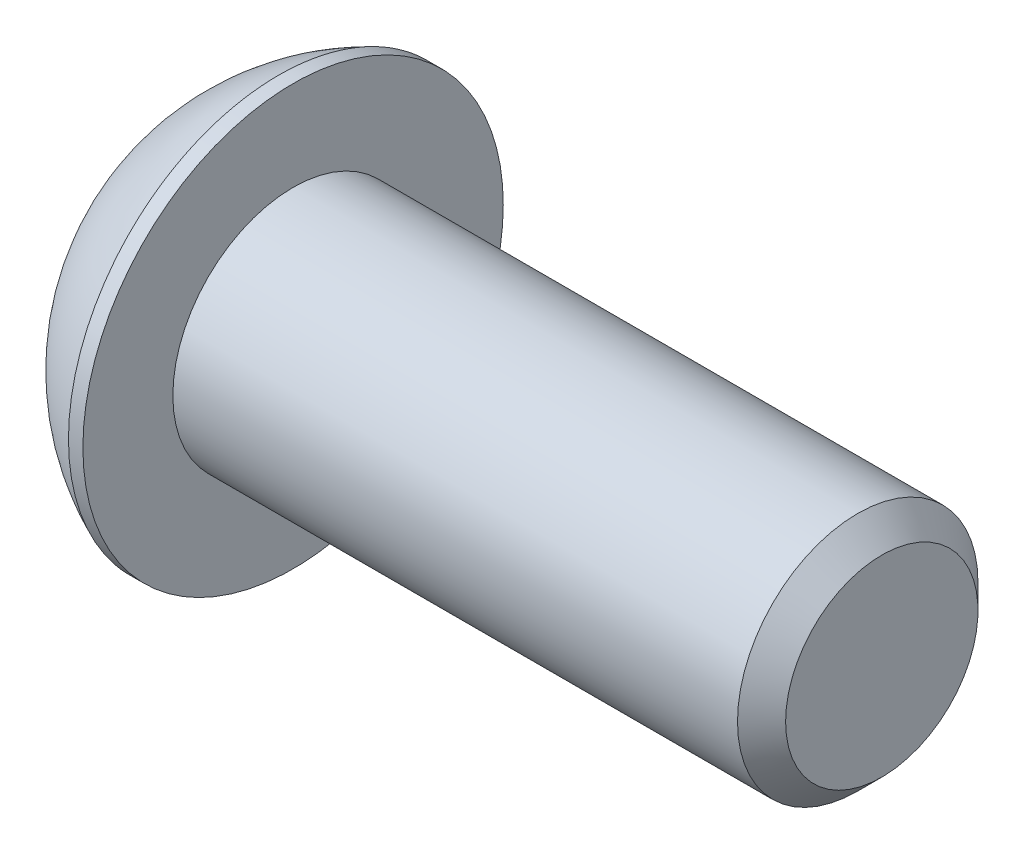
ISO-10303-21;
HEADER;
FILE_DESCRIPTION(('STEP AP214'),'2;1');
FILE_NAME('part.step','',(''),(''),'','','');
FILE_SCHEMA(('AUTOMOTIVE_DESIGN { 1 0 10303 214 1 1 1 1 }'));
ENDSEC;
DATA;
#1=APPLICATION_CONTEXT('core data for automotive mechanical design processes');
#2=APPLICATION_PROTOCOL_DEFINITION('international standard','automotive_design',2000,#1);
#3=PRODUCT_CONTEXT('',#1,'mechanical');
#4=PRODUCT('Part','Part','',(#3));
#5=PRODUCT_RELATED_PRODUCT_CATEGORY('part','',(#4));
#6=PRODUCT_DEFINITION_FORMATION('','',#4);
#7=PRODUCT_DEFINITION_CONTEXT('part definition',#1,'design');
#8=PRODUCT_DEFINITION('design','',#6,#7);
#9=PRODUCT_DEFINITION_SHAPE('','',#8);
#10=(LENGTH_UNIT() NAMED_UNIT(*) SI_UNIT(.MILLI.,.METRE.));
#11=(NAMED_UNIT(*) PLANE_ANGLE_UNIT() SI_UNIT($,.RADIAN.));
#12=(NAMED_UNIT(*) SI_UNIT($,.STERADIAN.) SOLID_ANGLE_UNIT());
#13=UNCERTAINTY_MEASURE_WITH_UNIT(LENGTH_MEASURE(1.E-05),#10,'distance_accuracy_value','');
#14=(GEOMETRIC_REPRESENTATION_CONTEXT(3) GLOBAL_UNCERTAINTY_ASSIGNED_CONTEXT((#13)) GLOBAL_UNIT_ASSIGNED_CONTEXT((#10,
#11,#12)) REPRESENTATION_CONTEXT('',''));
#15=CARTESIAN_POINT('',(0.,0.,0.));
#16=DIRECTION('',(0.,0.,1.));
#17=DIRECTION('',(1.,0.,0.));
#18=AXIS2_PLACEMENT_3D('',#15,#16,#17);
#19=CARTESIAN_POINT('',(1.32080000000034,0.,0.));
#20=DIRECTION('',(-1.,0.,0.));
#21=DIRECTION('',(0.,0.,1.));
#22=AXIS2_PLACEMENT_3D('',#19,#20,#21);
#23=CONICAL_SURFACE('',#22,1.1937999999998,1.04719755119608);
#24=CARTESIAN_POINT('',(2.01004075135902,0.,-4.44089209850063E-13));
#25=VERTEX_POINT('',#24);
#26=VERTEX_LOOP('',#25);
#27=FACE_BOUND('',#26,.T.);
#28=CARTESIAN_POINT('',(1.32080000000009,0.,0.));
#29=DIRECTION('',(-1.,0.,0.));
#30=DIRECTION('',(0.,0.,1.));
#31=AXIS2_PLACEMENT_3D('',#28,#29,#30);
#32=CIRCLE('',#31,1.19380000000024);
#33=CARTESIAN_POINT('',(1.32080000000009,0.,1.19380000000024));
#34=VERTEX_POINT('',#33);
#35=EDGE_CURVE('E20',#34,#34,#32,.T.);
#36=ORIENTED_EDGE('',*,*,#35,.T.);
#37=EDGE_LOOP('',(#36));
#38=FACE_BOUND('',#37,.T.);
#39=ADVANCED_FACE('F17',(#27,#38),#23,.F.);
#40=CARTESIAN_POINT('',(1.3208,-2.29135888084633,0.));
#41=DIRECTION('',(1.,0.,0.));
#42=DIRECTION('',(0.,0.,-1.));
#43=AXIS2_PLACEMENT_3D('',#40,#41,#42);
#44=PLANE('',#43);
#45=DIRECTION('',(0.,1.,0.));
#46=VECTOR('',#45,1.);
#47=CARTESIAN_POINT('',(1.3208,-1.14567944042316,1.984375));
#48=LINE('',#47,#46);
#49=CARTESIAN_POINT('',(1.3208,1.14567944042316,1.984375));
#50=VERTEX_POINT('',#49);
#51=CARTESIAN_POINT('',(1.3208,-1.14567944042316,1.984375));
#52=VERTEX_POINT('',#51);
#53=EDGE_CURVE('E69',#50,#52,#48,.F.);
#54=ORIENTED_EDGE('',*,*,#53,.F.);
#55=DIRECTION('',(0.,0.5,-0.866025403784439));
#56=VECTOR('',#55,1.);
#57=CARTESIAN_POINT('',(1.3208,1.14567944042316,1.984375));
#58=LINE('',#57,#56);
#59=CARTESIAN_POINT('',(1.3208,2.29135888084633,0.));
#60=VERTEX_POINT('',#59);
#61=EDGE_CURVE('E287',#60,#50,#58,.F.);
#62=ORIENTED_EDGE('',*,*,#61,.F.);
#63=DIRECTION('',(0.,-0.5,-0.866025403784439));
#64=VECTOR('',#63,1.);
#65=CARTESIAN_POINT('',(1.3208,2.29135888084633,0.));
#66=LINE('',#65,#64);
#67=CARTESIAN_POINT('',(1.3208,1.14567944042316,-1.984375));
#68=VERTEX_POINT('',#67);
#69=EDGE_CURVE('E291',#68,#60,#66,.F.);
#70=ORIENTED_EDGE('',*,*,#69,.F.);
#71=DIRECTION('',(0.,1.,0.));
#72=VECTOR('',#71,1.);
#73=CARTESIAN_POINT('',(1.3208,1.14567944042316,-1.984375));
#74=LINE('',#73,#72);
#75=CARTESIAN_POINT('',(1.3208,-1.14567944042316,-1.984375));
#76=VERTEX_POINT('',#75);
#77=EDGE_CURVE('E296',#76,#68,#74,.T.);
#78=ORIENTED_EDGE('',*,*,#77,.F.);
#79=DIRECTION('',(0.,-0.500000000000001,0.866025403784438));
#80=VECTOR('',#79,1.);
#81=CARTESIAN_POINT('',(1.3208,-1.14567944042316,-1.984375));
#82=LINE('',#81,#80);
#83=CARTESIAN_POINT('',(1.3208,-2.29135888084633,0.));
#84=VERTEX_POINT('',#83);
#85=EDGE_CURVE('E301',#84,#76,#82,.F.);
#86=ORIENTED_EDGE('',*,*,#85,.F.);
#87=DIRECTION('',(0.,0.500000000000001,0.866025403784438));
#88=VECTOR('',#87,1.);
#89=CARTESIAN_POINT('',(1.3208,-2.29135888084633,0.));
#90=LINE('',#89,#88);
#91=EDGE_CURVE('E82',#52,#84,#90,.F.);
#92=ORIENTED_EDGE('',*,*,#91,.F.);
#93=EDGE_LOOP('',(#54,#62,#70,#78,#86,#92));
#94=FACE_BOUND('',#93,.T.);
#95=ORIENTED_EDGE('',*,*,#35,.F.);
#96=EDGE_LOOP('',(#95));
#97=FACE_BOUND('',#96,.T.);
#98=ADVANCED_FACE('F75',(#94,#97),#44,.F.);
#99=CARTESIAN_POINT('',(1.3208,-1.14567944042316,1.984375));
#100=DIRECTION('',(0.,0.,-1.));
#101=DIRECTION('',(0.,1.,0.));
#102=AXIS2_PLACEMENT_3D('',#99,#100,#101);
#103=PLANE('',#102);
#104=ORIENTED_EDGE('',*,*,#53,.T.);
#105=DIRECTION('',(1.,0.,0.));
#106=VECTOR('',#105,1.);
#107=CARTESIAN_POINT('',(1.3208,-1.14567944042316,1.984375));
#108=LINE('',#107,#106);
#109=CARTESIAN_POINT('',(0.,-1.14567944042316,1.984375));
#110=VERTEX_POINT('',#109);
#111=EDGE_CURVE('E79',#110,#52,#108,.T.);
#112=ORIENTED_EDGE('',*,*,#111,.F.);
#113=DIRECTION('',(0.,1.,0.));
#114=VECTOR('',#113,1.);
#115=CARTESIAN_POINT('',(0.,0.,1.984375));
#116=LINE('',#115,#114);
#117=CARTESIAN_POINT('',(0.,1.14567944042316,1.984375));
#118=VERTEX_POINT('',#117);
#119=EDGE_CURVE('E281',#118,#110,#116,.F.);
#120=ORIENTED_EDGE('',*,*,#119,.F.);
#121=DIRECTION('',(1.,0.,0.));
#122=VECTOR('',#121,1.);
#123=CARTESIAN_POINT('',(1.3208,1.14567944042316,1.984375));
#124=LINE('',#123,#122);
#125=EDGE_CURVE('E284',#50,#118,#124,.F.);
#126=ORIENTED_EDGE('',*,*,#125,.F.);
#127=EDGE_LOOP('',(#104,#112,#120,#126));
#128=FACE_BOUND('',#127,.T.);
#129=ADVANCED_FACE('F128',(#128),#103,.T.);
#130=CARTESIAN_POINT('',(1.3208,-2.29135888084633,0.));
#131=DIRECTION('',(0.,0.866025403784438,-0.500000000000001));
#132=DIRECTION('',(0.,0.500000000000001,0.866025403784438));
#133=AXIS2_PLACEMENT_3D('',#130,#131,#132);
#134=PLANE('',#133);
#135=ORIENTED_EDGE('',*,*,#91,.T.);
#136=DIRECTION('',(1.,0.,0.));
#137=VECTOR('',#136,1.);
#138=CARTESIAN_POINT('',(1.3208,-2.29135888084633,0.));
#139=LINE('',#138,#137);
#140=CARTESIAN_POINT('',(0.,-2.29135888084633,0.));
#141=VERTEX_POINT('',#140);
#142=EDGE_CURVE('E303',#141,#84,#139,.T.);
#143=ORIENTED_EDGE('',*,*,#142,.F.);
#144=DIRECTION('',(0.,-0.500000000000001,-0.866025403784438));
#145=VECTOR('',#144,1.);
#146=CARTESIAN_POINT('',(0.,-1.14567944042316,1.984375));
#147=LINE('',#146,#145);
#148=EDGE_CURVE('E278',#110,#141,#147,.T.);
#149=ORIENTED_EDGE('',*,*,#148,.F.);
#150=ORIENTED_EDGE('',*,*,#111,.T.);
#151=EDGE_LOOP('',(#135,#143,#149,#150));
#152=FACE_BOUND('',#151,.T.);
#153=ADVANCED_FACE('F124',(#152),#134,.T.);
#154=CARTESIAN_POINT('',(1.3208,-1.14567944042316,-1.984375));
#155=DIRECTION('',(0.,0.866025403784438,0.500000000000001));
#156=DIRECTION('',(0.,-0.500000000000001,0.866025403784438));
#157=AXIS2_PLACEMENT_3D('',#154,#155,#156);
#158=PLANE('',#157);
#159=ORIENTED_EDGE('',*,*,#85,.T.);
#160=DIRECTION('',(1.,0.,0.));
#161=VECTOR('',#160,1.);
#162=CARTESIAN_POINT('',(1.3208,-1.14567944042316,-1.984375));
#163=LINE('',#162,#161);
#164=CARTESIAN_POINT('',(0.,-1.14567944042316,-1.984375));
#165=VERTEX_POINT('',#164);
#166=EDGE_CURVE('E298',#165,#76,#163,.T.);
#167=ORIENTED_EDGE('',*,*,#166,.F.);
#168=DIRECTION('',(0.,0.500000000000001,-0.866025403784438));
#169=VECTOR('',#168,1.);
#170=CARTESIAN_POINT('',(0.,-2.29135888084633,0.));
#171=LINE('',#170,#169);
#172=EDGE_CURVE('E275',#141,#165,#171,.T.);
#173=ORIENTED_EDGE('',*,*,#172,.F.);
#174=ORIENTED_EDGE('',*,*,#142,.T.);
#175=EDGE_LOOP('',(#159,#167,#173,#174));
#176=FACE_BOUND('',#175,.T.);
#177=ADVANCED_FACE('F120',(#176),#158,.T.);
#178=CARTESIAN_POINT('',(1.3208,1.14567944042316,-1.984375));
#179=DIRECTION('',(0.,0.,1.));
#180=DIRECTION('',(1.,0.,0.));
#181=AXIS2_PLACEMENT_3D('',#178,#179,#180);
#182=PLANE('',#181);
#183=ORIENTED_EDGE('',*,*,#77,.T.);
#184=DIRECTION('',(1.,0.,0.));
#185=VECTOR('',#184,1.);
#186=CARTESIAN_POINT('',(1.3208,1.14567944042316,-1.984375));
#187=LINE('',#186,#185);
#188=CARTESIAN_POINT('',(0.,1.14567944042316,-1.984375));
#189=VERTEX_POINT('',#188);
#190=EDGE_CURVE('E293',#189,#68,#187,.T.);
#191=ORIENTED_EDGE('',*,*,#190,.F.);
#192=DIRECTION('',(0.,1.,0.));
#193=VECTOR('',#192,1.);
#194=CARTESIAN_POINT('',(0.,0.,-1.984375));
#195=LINE('',#194,#193);
#196=EDGE_CURVE('E272',#165,#189,#195,.T.);
#197=ORIENTED_EDGE('',*,*,#196,.F.);
#198=ORIENTED_EDGE('',*,*,#166,.T.);
#199=EDGE_LOOP('',(#183,#191,#197,#198));
#200=FACE_BOUND('',#199,.T.);
#201=ADVANCED_FACE('F117',(#200),#182,.T.);
#202=CARTESIAN_POINT('',(1.3208,2.29135888084633,0.));
#203=DIRECTION('',(0.,-0.866025403784439,0.5));
#204=DIRECTION('',(0.,-0.5,-0.866025403784439));
#205=AXIS2_PLACEMENT_3D('',#202,#203,#204);
#206=PLANE('',#205);
#207=ORIENTED_EDGE('',*,*,#69,.T.);
#208=DIRECTION('',(1.,0.,0.));
#209=VECTOR('',#208,1.);
#210=CARTESIAN_POINT('',(1.3208,2.29135888084633,0.));
#211=LINE('',#210,#209);
#212=CARTESIAN_POINT('',(0.,2.29135888084633,0.));
#213=VERTEX_POINT('',#212);
#214=EDGE_CURVE('E35',#213,#60,#211,.T.);
#215=ORIENTED_EDGE('',*,*,#214,.F.);
#216=DIRECTION('',(0.,0.5,0.866025403784439));
#217=VECTOR('',#216,1.);
#218=CARTESIAN_POINT('',(0.,1.14567944042316,-1.984375));
#219=LINE('',#218,#217);
#220=EDGE_CURVE('E269',#189,#213,#219,.T.);
#221=ORIENTED_EDGE('',*,*,#220,.F.);
#222=ORIENTED_EDGE('',*,*,#190,.T.);
#223=EDGE_LOOP('',(#207,#215,#221,#222));
#224=FACE_BOUND('',#223,.T.);
#225=ADVANCED_FACE('F113',(#224),#206,.T.);
#226=CARTESIAN_POINT('',(1.3208,1.14567944042316,1.984375));
#227=DIRECTION('',(0.,-0.866025403784439,-0.5));
#228=DIRECTION('',(0.,0.5,-0.866025403784439));
#229=AXIS2_PLACEMENT_3D('',#226,#227,#228);
#230=PLANE('',#229);
#231=ORIENTED_EDGE('',*,*,#61,.T.);
#232=ORIENTED_EDGE('',*,*,#125,.T.);
#233=DIRECTION('',(0.,-0.5,0.866025403784438));
#234=VECTOR('',#233,1.);
#235=CARTESIAN_POINT('',(0.,2.29135888084633,0.));
#236=LINE('',#235,#234);
#237=EDGE_CURVE('E100',#213,#118,#236,.T.);
#238=ORIENTED_EDGE('',*,*,#237,.F.);
#239=ORIENTED_EDGE('',*,*,#214,.T.);
#240=EDGE_LOOP('',(#231,#232,#238,#239));
#241=FACE_BOUND('',#240,.T.);
#242=ADVANCED_FACE('F109',(#241),#230,.T.);
#243=CARTESIAN_POINT('',(0.,0.,0.));
#244=DIRECTION('',(-1.,0.,0.));
#245=DIRECTION('',(0.,0.,1.));
#246=AXIS2_PLACEMENT_3D('',#243,#244,#245);
#247=PLANE('',#246);
#248=ORIENTED_EDGE('',*,*,#220,.T.);
#249=ORIENTED_EDGE('',*,*,#237,.T.);
#250=ORIENTED_EDGE('',*,*,#119,.T.);
#251=ORIENTED_EDGE('',*,*,#148,.T.);
#252=ORIENTED_EDGE('',*,*,#172,.T.);
#253=ORIENTED_EDGE('',*,*,#196,.T.);
#254=EDGE_LOOP('',(#248,#249,#250,#251,#252,#253));
#255=FACE_BOUND('',#254,.T.);
#256=CARTESIAN_POINT('',(0.,2.77495,0.));
#257=CARTESIAN_POINT('',(0.,2.77494953309947,0.0779118937523459));
#258=CARTESIAN_POINT('',(0.,2.77166578388025,0.15583810591977));
#259=CARTESIAN_POINT('',(0.,2.75855213600204,0.311152012455904));
#260=CARTESIAN_POINT('',(0.,2.74872030471467,0.388539541019556));
#261=CARTESIAN_POINT('',(0.,2.72255472645676,0.542341518735717));
#262=CARTESIAN_POINT('',(-2.70414110576258E-13,2.70621065843663,0.618754223567578));
#263=CARTESIAN_POINT('',(2.71501725221868E-13,2.66713326915777,0.769973634286023));
#264=CARTESIAN_POINT('',(1.01274952524446E-12,2.64439476297869,0.844778983646282));
#265=CARTESIAN_POINT('',(1.81909959813207E-12,2.56690195943351,1.06566239301792));
#266=CARTESIAN_POINT('',(4.77081687541822E-13,2.50280672569928,1.20857954243987));
#267=CARTESIAN_POINT('',(-4.76232447128612E-13,2.35149826934097,1.48160874561538));
#268=CARTESIAN_POINT('',(0.,2.26428416790397,1.61172031233499));
#269=CARTESIAN_POINT('',(0.,2.1181093928834,1.79445660654268));
#270=CARTESIAN_POINT('',(0.,2.06678693791626,1.85333128513996));
#271=CARTESIAN_POINT('',(0.,1.95940522984449,1.96650727912792));
#272=CARTESIAN_POINT('',(0.,1.90335059143535,2.02081294920044));
#273=CARTESIAN_POINT('',(0.,1.78683891013963,2.12453280878582));
#274=CARTESIAN_POINT('',(0.,1.72637988450322,2.1739447713554));
#275=CARTESIAN_POINT('',(0.,1.60151968865711,2.26750481692908));
#276=CARTESIAN_POINT('',(0.,1.53711760864537,2.31165167810847));
#277=CARTESIAN_POINT('',(0.,1.33869902291632,2.43567242603944));
#278=CARTESIAN_POINT('',(0.,1.19934704110695,2.507235886628));
#279=CARTESIAN_POINT('',(0.,0.910681609121881,2.62590828672821));
#280=CARTESIAN_POINT('',(0.,0.761368265357398,2.67301748742278));
#281=CARTESIAN_POINT('',(0.,0.456932649466623,2.74151230664007));
#282=CARTESIAN_POINT('',(0.,0.301810346322584,2.76289778778721));
#283=CARTESIAN_POINT('',(0.,-0.00982263870895171,2.77931595661156));
#284=CARTESIAN_POINT('',(0.,-0.166333320596448,2.77434864428877));
#285=CARTESIAN_POINT('',(0.,-0.476280836814452,2.73822217653073));
#286=CARTESIAN_POINT('',(0.,-0.629717687555985,2.70706316096981));
#287=CARTESIAN_POINT('',(0.,-0.929254830044274,2.61937980771149));
#288=CARTESIAN_POINT('',(0.,-1.0753550434132,2.56285519909568));
#289=CARTESIAN_POINT('',(0.,-1.28570692598579,2.46037024128109));
#290=CARTESIAN_POINT('',(0.,-1.35439130022287,2.42323494812896));
#291=CARTESIAN_POINT('',(0.,-1.488391287199,2.34331277270256));
#292=CARTESIAN_POINT('',(0.,-1.55370767631787,2.30052720108831));
#293=CARTESIAN_POINT('',(0.,-1.68047292776594,2.20962421887055));
#294=CARTESIAN_POINT('',(0.,-1.7419235278682,2.16150923122348));
#295=CARTESIAN_POINT('',(0.,-1.86060297067992,2.06024311301283));
#296=CARTESIAN_POINT('',(0.,-1.91782768181715,2.0070871669763));
#297=CARTESIAN_POINT('',(0.,-2.08239462196651,1.8407220856554));
#298=CARTESIAN_POINT('',(0.,-2.18279764272601,1.72049499758422));
#299=CARTESIAN_POINT('',(0.,-2.36195754944063,1.46487629213018));
#300=CARTESIAN_POINT('',(0.,-2.44071525816758,1.32948525142807));
#301=CARTESIAN_POINT('',(0.,-2.54098882695274,1.11796734074395));
#302=CARTESIAN_POINT('',(0.,-2.57146177392727,1.04596540008347));
#303=CARTESIAN_POINT('',(0.,-2.62621251108999,0.899689259475764));
#304=CARTESIAN_POINT('',(0.,-2.65049531495563,0.825416953360952));
#305=CARTESIAN_POINT('',(0.,-2.69267708798766,0.675215808695207));
#306=CARTESIAN_POINT('',(0.,-2.71058613777937,0.599289789313092));
#307=CARTESIAN_POINT('',(0.,-2.73994710360127,0.446213628496932));
#308=CARTESIAN_POINT('',(0.,-2.75140092413871,0.369063855024788));
#309=CARTESIAN_POINT('',(0.,-2.76470470685522,0.24316208817343));
#310=CARTESIAN_POINT('',(0.,-2.76854547596618,0.194611672428577));
#311=CARTESIAN_POINT('',(0.,-2.77366826843264,0.0973760351839812));
#312=CARTESIAN_POINT('',(0.,-2.77495029178814,0.0486908136842395));
#313=CARTESIAN_POINT('',(0.,-2.77494953309947,-0.0779118937523475));
#314=CARTESIAN_POINT('',(0.,-2.77166578388025,-0.155838105919772));
#315=CARTESIAN_POINT('',(0.,-2.75855213600204,-0.311152012455906));
#316=CARTESIAN_POINT('',(0.,-2.74872030471467,-0.388539541019558));
#317=CARTESIAN_POINT('',(0.,-2.72255472645677,-0.542341518735719));
#318=CARTESIAN_POINT('',(-2.70149297926331E-13,-2.70621065843663,-0.61875422356758));
#319=CARTESIAN_POINT('',(2.712366972268E-13,-2.66713326915777,-0.769973634286024));
#320=CARTESIAN_POINT('',(1.0114146773846E-12,-2.64439476297869,-0.844778983646283));
#321=CARTESIAN_POINT('',(1.81656702958366E-12,-2.5669019594335,-1.06566239301792));
#322=CARTESIAN_POINT('',(4.7641829195856E-13,-2.50280672569928,-1.20857954243988));
#323=CARTESIAN_POINT('',(-4.75569026324205E-13,-2.35149826934097,-1.48160874561538));
#324=CARTESIAN_POINT('',(0.,-2.26428416790396,-1.61172031233499));
#325=CARTESIAN_POINT('',(0.,-2.1181093928834,-1.79445660654268));
#326=CARTESIAN_POINT('',(0.,-2.06678693791626,-1.85333128513997));
#327=CARTESIAN_POINT('',(0.,-1.95940522984449,-1.96650727912792));
#328=CARTESIAN_POINT('',(0.,-1.90335059143535,-2.02081294920044));
#329=CARTESIAN_POINT('',(0.,-1.78683891013963,-2.12453280878582));
#330=CARTESIAN_POINT('',(0.,-1.72637988450322,-2.1739447713554));
#331=CARTESIAN_POINT('',(0.,-1.60151968865711,-2.26750481692908));
#332=CARTESIAN_POINT('',(0.,-1.53711760864537,-2.31165167810847));
#333=CARTESIAN_POINT('',(0.,-1.33869902291632,-2.43567242603944));
#334=CARTESIAN_POINT('',(0.,-1.19934704110695,-2.507235886628));
#335=CARTESIAN_POINT('',(0.,-0.91068160912188,-2.62590828672821));
#336=CARTESIAN_POINT('',(0.,-0.761368265357396,-2.67301748742278));
#337=CARTESIAN_POINT('',(0.,-0.456932649466621,-2.74151230664007));
#338=CARTESIAN_POINT('',(0.,-0.301810346322582,-2.76289778778721));
#339=CARTESIAN_POINT('',(0.,0.00982263870895353,-2.77931595661156));
#340=CARTESIAN_POINT('',(0.,0.16633332059645,-2.77434864428876));
#341=CARTESIAN_POINT('',(0.,0.476280836814454,-2.73822217653073));
#342=CARTESIAN_POINT('',(0.,0.629717687555987,-2.70706316096981));
#343=CARTESIAN_POINT('',(0.,0.929254830044276,-2.6193798077115));
#344=CARTESIAN_POINT('',(0.,1.0753550434132,-2.56285519909568));
#345=CARTESIAN_POINT('',(0.,1.28570692598579,-2.46037024128109));
#346=CARTESIAN_POINT('',(0.,1.35439130022287,-2.42323494812896));
#347=CARTESIAN_POINT('',(0.,1.488391287199,-2.34331277270256));
#348=CARTESIAN_POINT('',(0.,1.55370767631787,-2.30052720108831));
#349=CARTESIAN_POINT('',(0.,1.68047292776594,-2.20962421887055));
#350=CARTESIAN_POINT('',(0.,1.7419235278682,-2.16150923122348));
#351=CARTESIAN_POINT('',(0.,1.86060297067992,-2.06024311301282));
#352=CARTESIAN_POINT('',(0.,1.91782768181716,-2.0070871669763));
#353=CARTESIAN_POINT('',(0.,2.08239462196651,-1.8407220856554));
#354=CARTESIAN_POINT('',(0.,2.18279764272601,-1.72049499758422));
#355=CARTESIAN_POINT('',(0.,2.36195754944063,-1.46487629213018));
#356=CARTESIAN_POINT('',(0.,2.44071525816757,-1.32948525142807));
#357=CARTESIAN_POINT('',(0.,2.54098882695273,-1.11796734074395));
#358=CARTESIAN_POINT('',(0.,2.57146177392727,-1.04596540008347));
#359=CARTESIAN_POINT('',(0.,2.62621251108999,-0.899689259475765));
#360=CARTESIAN_POINT('',(0.,2.65049531495563,-0.825416953360953));
#361=CARTESIAN_POINT('',(0.,2.69267708798766,-0.675215808695207));
#362=CARTESIAN_POINT('',(0.,2.71058613777936,-0.599289789313092));
#363=CARTESIAN_POINT('',(0.,2.73994710360127,-0.446213628496932));
#364=CARTESIAN_POINT('',(0.,2.75140092413871,-0.369063855024789));
#365=CARTESIAN_POINT('',(0.,2.76470470685522,-0.243162088173432));
#366=CARTESIAN_POINT('',(0.,2.76854547596618,-0.194611672428578));
#367=CARTESIAN_POINT('',(0.,2.77366826843264,-0.0973760351839823));
#368=CARTESIAN_POINT('',(0.,2.77495029178814,-0.0486908136842408));
#369=CARTESIAN_POINT('',(0.,2.77495,0.));
#370=B_SPLINE_CURVE_WITH_KNOTS('',3,(#256,#257,#258,#259,#260,#261,#262,#263,#264,#265,#266,
#267,#268,#269,#270,#271,#272,#273,#274,#275,#276,#277,#278,#279,#280,#281,#282,#283,#284,#285,
#286,#287,#288,#289,#290,#291,#292,#293,#294,#295,#296,#297,#298,#299,#300,#301,#302,#303,#304,
#305,#306,#307,#308,#309,#310,#311,#312,#313,#314,#315,#316,#317,#318,#319,#320,#321,#322,#323,
#324,#325,#326,#327,#328,#329,#330,#331,#332,#333,#334,#335,#336,#337,#338,#339,#340,#341,#342,
#343,#344,#345,#346,#347,#348,#349,#350,#351,#352,#353,#354,#355,#356,#357,#358,#359,#360,#361,
#362,#363,#364,#365,#366,#367,#368,#369),.UNSPECIFIED.,.T.,.F.,(4,2,2,2,2,2,2,2,2,2,2,2,2,2,2,2,
2,2,2,2,2,2,2,2,2,2,2,2,2,2,2,2,2,2,2,2,2,2,2,2,2,2,2,2,2,2,2,2,2,2,2,2,2,2,2,2,4),(0.,
0.233690856748162,0.467450716578751,0.701582538521471,0.935904756015414,1.40343220467667,
1.87097742791502,2.10505636898837,2.33890962270652,2.57286880998746,2.80688218486306,
3.27442101763127,3.74195485676357,4.20949119271389,4.67702752866417,5.14456136779641,
5.61210020056468,5.84611357544033,6.08007276272136,6.31392601643949,6.54800495751273,
7.01555018075072,7.48307762941212,7.71739984690652,7.95153166884955,8.18529152868023,
8.41898238542855,8.56502681353347,8.71107124163843,8.94476209838659,9.17852195821718,
9.4126537801599,9.64697599765384,10.1145034463151,10.5820486695534,10.8161276106268,
11.0499808643449,11.2839400516259,11.5179534265015,11.9854922592697,12.453026098402,
12.9205624343523,13.3880987703026,13.8556326094348,14.3231714422031,14.5571848170788,
14.7911440043598,15.0249972580779,15.2590761991512,15.7266214223891,16.1941488710506,
16.4284710885449,16.662602910488,16.8963627703186,17.130053627067,17.2760980551719,
17.4221424832769),.UNSPECIFIED.);
#371=CARTESIAN_POINT('',(0.,2.77495,0.));
#372=VERTEX_POINT('',#371);
#373=EDGE_CURVE('E94',#372,#372,#370,.T.);
#374=ORIENTED_EDGE('',*,*,#373,.F.);
#375=EDGE_LOOP('',(#374));
#376=FACE_BOUND('',#375,.T.);
#377=ADVANCED_FACE('F105',(#255,#376),#247,.T.);
#378=CARTESIAN_POINT('',(5.37260881410256,0.,0.));
#379=DIRECTION('',(0.,1.,0.));
#380=DIRECTION('',(1.,0.,0.));
#381=AXIS2_PLACEMENT_3D('',#378,#379,#380);
#382=SPHERICAL_SURFACE('',#381,6.04692260342999);
#383=CARTESIAN_POINT('',(2.9718,0.,0.));
#384=DIRECTION('',(-1.,0.,0.));
#385=DIRECTION('',(0.,0.,1.));
#386=AXIS2_PLACEMENT_3D('',#383,#384,#385);
#387=CIRCLE('',#386,5.5499);
#388=CARTESIAN_POINT('',(2.9718,0.,5.5499));
#389=VERTEX_POINT('',#388);
#390=EDGE_CURVE('E92',#389,#389,#387,.F.);
#391=ORIENTED_EDGE('',*,*,#390,.F.);
#392=EDGE_LOOP('',(#391));
#393=FACE_BOUND('',#392,.T.);
#394=ORIENTED_EDGE('',*,*,#373,.T.);
#395=EDGE_LOOP('',(#394));
#396=FACE_BOUND('',#395,.T.);
#397=ADVANCED_FACE('F101',(#393,#396),#382,.T.);
#398=CARTESIAN_POINT('',(18.8976,0.,0.));
#399=DIRECTION('',(-1.,0.,0.));
#400=DIRECTION('',(0.,0.,1.));
#401=AXIS2_PLACEMENT_3D('',#398,#399,#400);
#402=PLANE('',#401);
#403=CARTESIAN_POINT('',(18.8976000000594,0.,0.));
#404=DIRECTION('',(-1.,0.,0.));
#405=DIRECTION('',(0.,0.,1.));
#406=AXIS2_PLACEMENT_3D('',#403,#404,#405);
#407=CIRCLE('',#406,2.53999999995358);
#408=CARTESIAN_POINT('',(18.8976000000594,0.,2.53999999995358));
#409=VERTEX_POINT('',#408);
#410=EDGE_CURVE('E89',#409,#409,#407,.T.);
#411=ORIENTED_EDGE('',*,*,#410,.F.);
#412=EDGE_LOOP('',(#411));
#413=FACE_BOUND('',#412,.T.);
#414=ADVANCED_FACE('F154',(#413),#402,.F.);
#415=CARTESIAN_POINT('',(0.,0.,0.));
#416=DIRECTION('',(-1.,0.,0.));
#417=DIRECTION('',(0.,0.,1.));
#418=AXIS2_PLACEMENT_3D('',#415,#416,#417);
#419=CYLINDRICAL_SURFACE('',#418,5.5499);
#420=ORIENTED_EDGE('',*,*,#390,.T.);
#421=EDGE_LOOP('',(#420));
#422=FACE_BOUND('',#421,.T.);
#423=CARTESIAN_POINT('',(3.3528,0.,0.));
#424=DIRECTION('',(-1.,0.,0.));
#425=DIRECTION('',(0.,0.,1.));
#426=AXIS2_PLACEMENT_3D('',#423,#424,#425);
#427=CIRCLE('',#426,5.5499);
#428=CARTESIAN_POINT('',(3.3528,0.,5.5499));
#429=VERTEX_POINT('',#428);
#430=EDGE_CURVE('E86',#429,#429,#427,.T.);
#431=ORIENTED_EDGE('',*,*,#430,.T.);
#432=EDGE_LOOP('',(#431));
#433=FACE_BOUND('',#432,.T.);
#434=ADVANCED_FACE('F151',(#422,#433),#419,.T.);
#435=CARTESIAN_POINT('',(18.262600000071,0.,0.));
#436=DIRECTION('',(-1.,0.,0.));
#437=DIRECTION('',(0.,0.,1.));
#438=AXIS2_PLACEMENT_3D('',#435,#436,#437);
#439=CONICAL_SURFACE('',#438,3.17499999994197,0.785398163397448);
#440=CARTESIAN_POINT('',(18.2626,0.,0.));
#441=DIRECTION('',(-1.,0.,0.));
#442=DIRECTION('',(0.,0.,1.));
#443=AXIS2_PLACEMENT_3D('',#440,#441,#442);
#444=CIRCLE('',#443,3.175);
#445=CARTESIAN_POINT('',(18.2626,0.,3.175));
#446=VERTEX_POINT('',#445);
#447=EDGE_CURVE('E26',#446,#446,#444,.T.);
#448=ORIENTED_EDGE('',*,*,#447,.F.);
#449=EDGE_LOOP('',(#448));
#450=FACE_BOUND('',#449,.T.);
#451=ORIENTED_EDGE('',*,*,#410,.T.);
#452=EDGE_LOOP('',(#451));
#453=FACE_BOUND('',#452,.T.);
#454=ADVANCED_FACE('F144',(#450,#453),#439,.T.);
#455=CARTESIAN_POINT('',(3.3528,3.175,0.));
#456=DIRECTION('',(-1.,0.,0.));
#457=DIRECTION('',(0.,0.,1.));
#458=AXIS2_PLACEMENT_3D('',#455,#456,#457);
#459=PLANE('',#458);
#460=CARTESIAN_POINT('',(3.3528,0.,0.));
#461=DIRECTION('',(-1.,0.,0.));
#462=DIRECTION('',(0.,0.,1.));
#463=AXIS2_PLACEMENT_3D('',#460,#461,#462);
#464=CIRCLE('',#463,3.175);
#465=CARTESIAN_POINT('',(3.3528,0.,3.175));
#466=VERTEX_POINT('',#465);
#467=EDGE_CURVE('E11',#466,#466,#464,.F.);
#468=ORIENTED_EDGE('',*,*,#467,.F.);
#469=EDGE_LOOP('',(#468));
#470=FACE_BOUND('',#469,.T.);
#471=ORIENTED_EDGE('',*,*,#430,.F.);
#472=EDGE_LOOP('',(#471));
#473=FACE_BOUND('',#472,.T.);
#474=ADVANCED_FACE('F138',(#470,#473),#459,.F.);
#475=CARTESIAN_POINT('',(0.,0.,0.));
#476=DIRECTION('',(-1.,0.,0.));
#477=DIRECTION('',(0.,0.,1.));
#478=AXIS2_PLACEMENT_3D('',#475,#476,#477);
#479=CYLINDRICAL_SURFACE('',#478,3.175);
#480=ORIENTED_EDGE('',*,*,#467,.T.);
#481=EDGE_LOOP('',(#480));
#482=FACE_BOUND('',#481,.T.);
#483=ORIENTED_EDGE('',*,*,#447,.T.);
#484=EDGE_LOOP('',(#483));
#485=FACE_BOUND('',#484,.T.);
#486=ADVANCED_FACE('F136',(#482,#485),#479,.T.);
#487=CLOSED_SHELL('',(#39,#98,#129,#153,#177,#201,#225,#242,#377,#397,#414,#434,#454,#474,#486));
#488=MANIFOLD_SOLID_BREP('B1',#487);
#489=ADVANCED_BREP_SHAPE_REPRESENTATION('',(#18,#488),#14);
#490=SHAPE_DEFINITION_REPRESENTATION(#9,#489);
ENDSEC;
END-ISO-10303-21;
